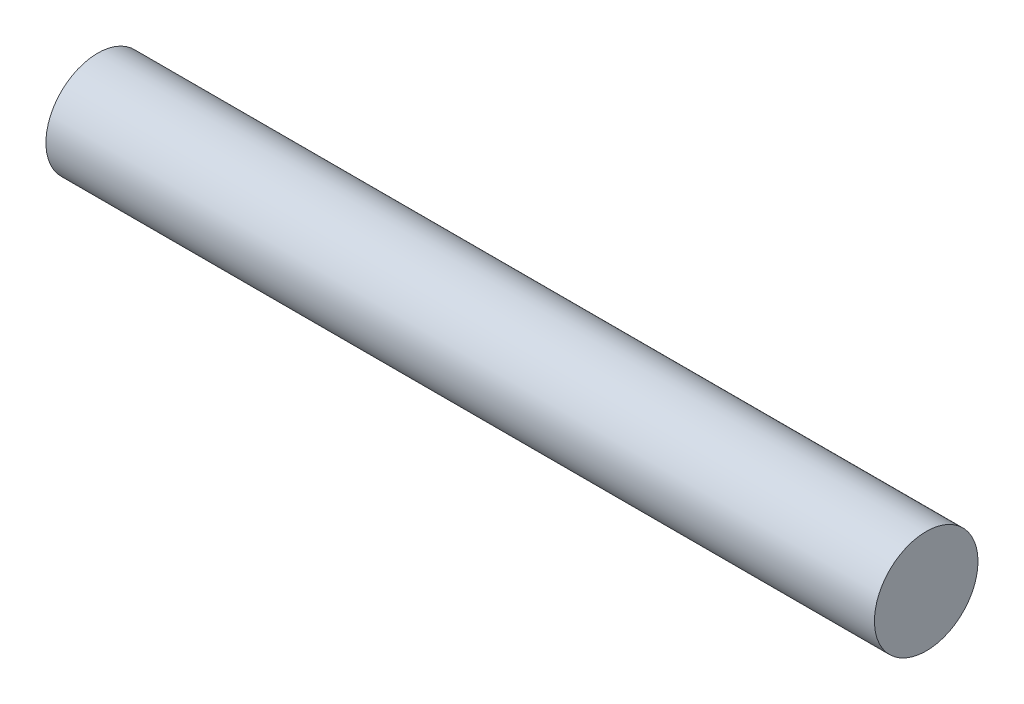
ISO-10303-21;
HEADER;
FILE_DESCRIPTION(('STEP AP214'),'2;1');
FILE_NAME('part.step','',(''),(''),'','','');
FILE_SCHEMA(('AUTOMOTIVE_DESIGN { 1 0 10303 214 1 1 1 1 }'));
ENDSEC;
DATA;
#1=APPLICATION_CONTEXT('core data for automotive mechanical design processes');
#2=APPLICATION_PROTOCOL_DEFINITION('international standard','automotive_design',2000,#1);
#3=PRODUCT_CONTEXT('',#1,'mechanical');
#4=PRODUCT('Part','Part','',(#3));
#5=PRODUCT_RELATED_PRODUCT_CATEGORY('part','',(#4));
#6=PRODUCT_DEFINITION_FORMATION('','',#4);
#7=PRODUCT_DEFINITION_CONTEXT('part definition',#1,'design');
#8=PRODUCT_DEFINITION('design','',#6,#7);
#9=PRODUCT_DEFINITION_SHAPE('','',#8);
#10=(LENGTH_UNIT() NAMED_UNIT(*) SI_UNIT(.MILLI.,.METRE.));
#11=(NAMED_UNIT(*) PLANE_ANGLE_UNIT() SI_UNIT($,.RADIAN.));
#12=(NAMED_UNIT(*) SI_UNIT($,.STERADIAN.) SOLID_ANGLE_UNIT());
#13=UNCERTAINTY_MEASURE_WITH_UNIT(LENGTH_MEASURE(1.E-05),#10,'distance_accuracy_value','');
#14=(GEOMETRIC_REPRESENTATION_CONTEXT(3) GLOBAL_UNCERTAINTY_ASSIGNED_CONTEXT((#13)) GLOBAL_UNIT_ASSIGNED_CONTEXT((#10,
#11,#12)) REPRESENTATION_CONTEXT('',''));
#15=CARTESIAN_POINT('',(0.,0.,0.));
#16=DIRECTION('',(0.,0.,1.));
#17=DIRECTION('',(1.,0.,0.));
#18=AXIS2_PLACEMENT_3D('',#15,#16,#17);
#19=CARTESIAN_POINT('',(200.,0.,0.));
#20=DIRECTION('',(-1.,0.,0.));
#21=DIRECTION('',(0.,0.,1.));
#22=AXIS2_PLACEMENT_3D('',#19,#20,#21);
#23=CYLINDRICAL_SURFACE('',#22,25.);
#24=CARTESIAN_POINT('',(200.,0.,0.));
#25=DIRECTION('',(1.,0.,0.));
#26=DIRECTION('',(0.,0.,-1.));
#27=AXIS2_PLACEMENT_3D('',#24,#25,#26);
#28=CIRCLE('',#27,25.);
#29=CARTESIAN_POINT('',(200.,0.,-25.));
#30=VERTEX_POINT('',#29);
#31=EDGE_CURVE('E10',#30,#30,#28,.T.);
#32=ORIENTED_EDGE('',*,*,#31,.F.);
#33=EDGE_LOOP('',(#32));
#34=FACE_BOUND('',#33,.T.);
#35=CARTESIAN_POINT('',(-200.,0.,0.));
#36=DIRECTION('',(1.,0.,0.));
#37=DIRECTION('',(0.,0.,-1.));
#38=AXIS2_PLACEMENT_3D('',#35,#36,#37);
#39=CIRCLE('',#38,25.);
#40=CARTESIAN_POINT('',(-200.,0.,-25.));
#41=VERTEX_POINT('',#40);
#42=EDGE_CURVE('E34',#41,#41,#39,.T.);
#43=ORIENTED_EDGE('',*,*,#42,.T.);
#44=EDGE_LOOP('',(#43));
#45=FACE_BOUND('',#44,.T.);
#46=ADVANCED_FACE('F31',(#34,#45),#23,.T.);
#47=CARTESIAN_POINT('',(200.,0.,0.));
#48=DIRECTION('',(1.,0.,0.));
#49=DIRECTION('',(0.,0.,-1.));
#50=AXIS2_PLACEMENT_3D('',#47,#48,#49);
#51=PLANE('',#50);
#52=ORIENTED_EDGE('',*,*,#31,.T.);
#53=EDGE_LOOP('',(#52));
#54=FACE_BOUND('',#53,.T.);
#55=ADVANCED_FACE('F46',(#54),#51,.T.);
#56=CARTESIAN_POINT('',(-200.,0.,0.));
#57=DIRECTION('',(1.,0.,0.));
#58=DIRECTION('',(0.,0.,-1.));
#59=AXIS2_PLACEMENT_3D('',#56,#57,#58);
#60=PLANE('',#59);
#61=ORIENTED_EDGE('',*,*,#42,.F.);
#62=EDGE_LOOP('',(#61));
#63=FACE_BOUND('',#62,.T.);
#64=ADVANCED_FACE('F44',(#63),#60,.F.);
#65=CLOSED_SHELL('',(#46,#55,#64));
#66=MANIFOLD_SOLID_BREP('B2',#65);
#67=ADVANCED_BREP_SHAPE_REPRESENTATION('',(#18,#66),#14);
#68=SHAPE_DEFINITION_REPRESENTATION(#9,#67);
ENDSEC;
END-ISO-10303-21;
